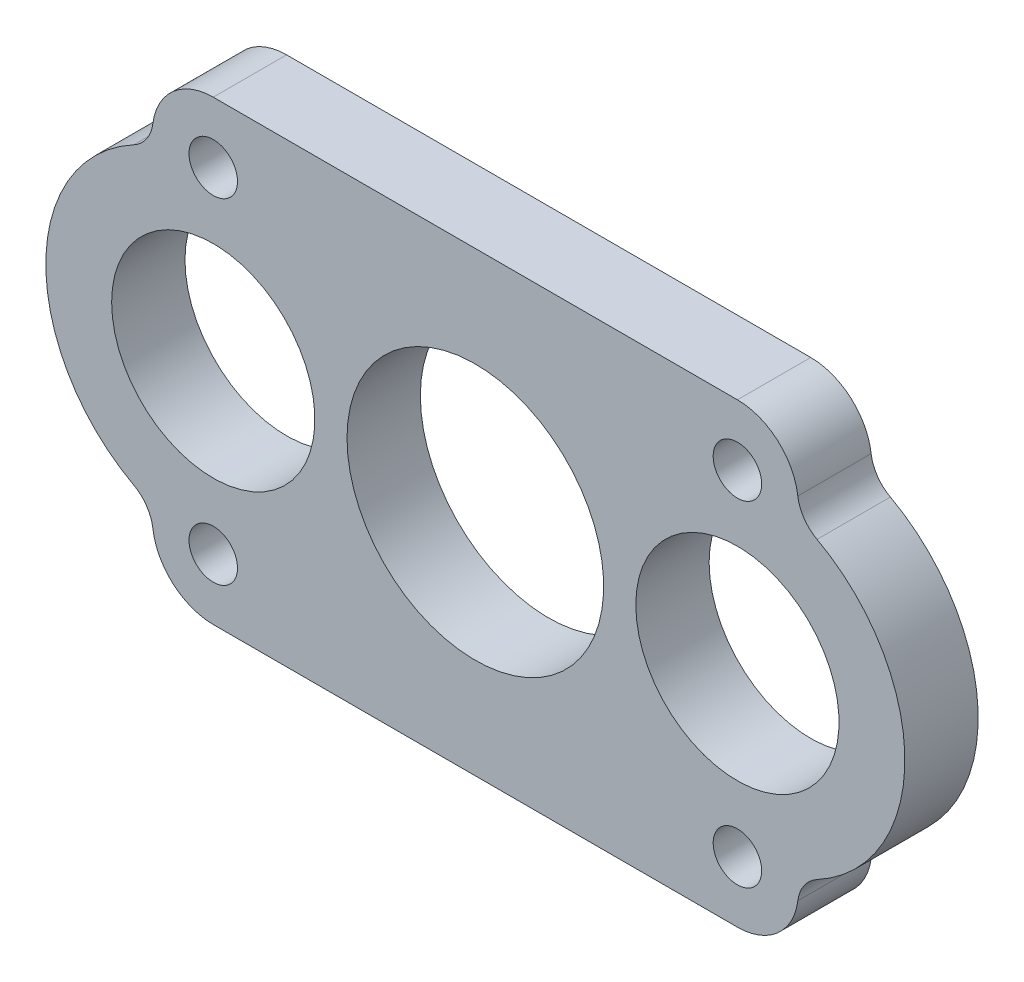
ISO-10303-21;
HEADER;
FILE_DESCRIPTION(('STEP AP214'),'2;1');
FILE_NAME('part.step','',(''),(''),'','','');
FILE_SCHEMA(('AUTOMOTIVE_DESIGN { 1 0 10303 214 1 1 1 1 }'));
ENDSEC;
DATA;
#1=APPLICATION_CONTEXT('core data for automotive mechanical design processes');
#2=APPLICATION_PROTOCOL_DEFINITION('international standard','automotive_design',2000,#1);
#3=PRODUCT_CONTEXT('',#1,'mechanical');
#4=PRODUCT('Part','Part','',(#3));
#5=PRODUCT_RELATED_PRODUCT_CATEGORY('part','',(#4));
#6=PRODUCT_DEFINITION_FORMATION('','',#4);
#7=PRODUCT_DEFINITION_CONTEXT('part definition',#1,'design');
#8=PRODUCT_DEFINITION('design','',#6,#7);
#9=PRODUCT_DEFINITION_SHAPE('','',#8);
#10=(LENGTH_UNIT() NAMED_UNIT(*) SI_UNIT(.MILLI.,.METRE.));
#11=(NAMED_UNIT(*) PLANE_ANGLE_UNIT() SI_UNIT($,.RADIAN.));
#12=(NAMED_UNIT(*) SI_UNIT($,.STERADIAN.) SOLID_ANGLE_UNIT());
#13=UNCERTAINTY_MEASURE_WITH_UNIT(LENGTH_MEASURE(1.E-05),#10,'distance_accuracy_value','');
#14=(GEOMETRIC_REPRESENTATION_CONTEXT(3) GLOBAL_UNCERTAINTY_ASSIGNED_CONTEXT((#13)) GLOBAL_UNIT_ASSIGNED_CONTEXT((#10,
#11,#12)) REPRESENTATION_CONTEXT('',''));
#15=CARTESIAN_POINT('',(0.,0.,0.));
#16=DIRECTION('',(0.,0.,1.));
#17=DIRECTION('',(1.,0.,0.));
#18=AXIS2_PLACEMENT_3D('',#15,#16,#17);
#19=CARTESIAN_POINT('',(-22.6949,0.,0.));
#20=DIRECTION('',(0.,0.,1.));
#21=DIRECTION('',(1.,0.,0.));
#22=AXIS2_PLACEMENT_3D('',#19,#20,#21);
#23=PLANE('',#22);
#24=CARTESIAN_POINT('',(22.6949,14.5,0.));
#25=DIRECTION('',(0.,0.,-1.));
#26=DIRECTION('',(-1.,0.,0.));
#27=AXIS2_PLACEMENT_3D('',#24,#25,#26);
#28=CIRCLE('',#27,2.1);
#29=CARTESIAN_POINT('',(20.5949,14.5,0.));
#30=VERTEX_POINT('',#29);
#31=EDGE_CURVE('E176',#30,#30,#28,.F.);
#32=ORIENTED_EDGE('',*,*,#31,.T.);
#33=EDGE_LOOP('',(#32));
#34=FACE_BOUND('',#33,.T.);
#35=CARTESIAN_POINT('',(22.6949,0.,0.));
#36=DIRECTION('',(0.,0.,-1.));
#37=DIRECTION('',(-1.,0.,0.));
#38=AXIS2_PLACEMENT_3D('',#35,#36,#37);
#39=CIRCLE('',#38,8.8);
#40=CARTESIAN_POINT('',(13.8949,0.,0.));
#41=VERTEX_POINT('',#40);
#42=EDGE_CURVE('E20',#41,#41,#39,.F.);
#43=ORIENTED_EDGE('',*,*,#42,.T.);
#44=EDGE_LOOP('',(#43));
#45=FACE_BOUND('',#44,.T.);
#46=CARTESIAN_POINT('',(22.6949,-14.5,0.));
#47=DIRECTION('',(0.,0.,-1.));
#48=DIRECTION('',(-1.,0.,0.));
#49=AXIS2_PLACEMENT_3D('',#46,#47,#48);
#50=CIRCLE('',#49,2.1);
#51=CARTESIAN_POINT('',(20.5949,-14.5,0.));
#52=VERTEX_POINT('',#51);
#53=EDGE_CURVE('E182',#52,#52,#50,.F.);
#54=ORIENTED_EDGE('',*,*,#53,.T.);
#55=EDGE_LOOP('',(#54));
#56=FACE_BOUND('',#55,.T.);
#57=CARTESIAN_POINT('',(-22.6949,14.5,0.));
#58=DIRECTION('',(0.,0.,-1.));
#59=DIRECTION('',(-1.,0.,0.));
#60=AXIS2_PLACEMENT_3D('',#57,#58,#59);
#61=CIRCLE('',#60,2.1);
#62=CARTESIAN_POINT('',(-24.7949,14.5,0.));
#63=VERTEX_POINT('',#62);
#64=EDGE_CURVE('E158',#63,#63,#61,.F.);
#65=ORIENTED_EDGE('',*,*,#64,.T.);
#66=EDGE_LOOP('',(#65));
#67=FACE_BOUND('',#66,.T.);
#68=CARTESIAN_POINT('',(-22.6949,-14.5,0.));
#69=DIRECTION('',(0.,0.,-1.));
#70=DIRECTION('',(-1.,0.,0.));
#71=AXIS2_PLACEMENT_3D('',#68,#69,#70);
#72=CIRCLE('',#71,2.1);
#73=CARTESIAN_POINT('',(-24.7949,-14.5,0.));
#74=VERTEX_POINT('',#73);
#75=EDGE_CURVE('E127',#74,#74,#72,.F.);
#76=ORIENTED_EDGE('',*,*,#75,.T.);
#77=EDGE_LOOP('',(#76));
#78=FACE_BOUND('',#77,.T.);
#79=CARTESIAN_POINT('',(-22.6949,0.,0.));
#80=DIRECTION('',(0.,0.,-1.));
#81=DIRECTION('',(-1.,0.,0.));
#82=AXIS2_PLACEMENT_3D('',#79,#80,#81);
#83=CIRCLE('',#82,8.8);
#84=CARTESIAN_POINT('',(-31.4949,0.,0.));
#85=VERTEX_POINT('',#84);
#86=EDGE_CURVE('E113',#85,#85,#83,.F.);
#87=ORIENTED_EDGE('',*,*,#86,.T.);
#88=EDGE_LOOP('',(#87));
#89=FACE_BOUND('',#88,.T.);
#90=CARTESIAN_POINT('',(0.,0.,0.));
#91=DIRECTION('',(0.,0.,-1.));
#92=DIRECTION('',(-1.,0.,0.));
#93=AXIS2_PLACEMENT_3D('',#90,#91,#92);
#94=CIRCLE('',#93,11.1125);
#95=CARTESIAN_POINT('',(-11.1125,0.,0.));
#96=VERTEX_POINT('',#95);
#97=EDGE_CURVE('E124',#96,#96,#94,.F.);
#98=ORIENTED_EDGE('',*,*,#97,.T.);
#99=EDGE_LOOP('',(#98));
#100=FACE_BOUND('',#99,.T.);
#101=CARTESIAN_POINT('',(-31.1251698783673,15.5927718965517,0.));
#102=DIRECTION('',(0.,0.,-1.));
#103=DIRECTION('',(-1.,0.,0.));
#104=AXIS2_PLACEMENT_3D('',#101,#102,#103);
#105=CIRCLE('',#104,3.2258);
#106=CARTESIAN_POINT('',(-29.5910013458533,12.755147440454,0.));
#107=VERTEX_POINT('',#106);
#108=CARTESIAN_POINT('',(-27.926133955438,15.178097561913,0.));
#109=VERTEX_POINT('',#108);
#110=EDGE_CURVE('E107',#107,#109,#105,.F.);
#111=ORIENTED_EDGE('',*,*,#110,.T.);
#112=CARTESIAN_POINT('',(-22.6949,14.5,0.));
#113=DIRECTION('',(0.,0.,-1.));
#114=DIRECTION('',(-1.,0.,0.));
#115=AXIS2_PLACEMENT_3D('',#112,#113,#114);
#116=CIRCLE('',#115,5.275);
#117=CARTESIAN_POINT('',(-22.6949,19.775,0.));
#118=VERTEX_POINT('',#117);
#119=EDGE_CURVE('E131',#118,#109,#116,.F.);
#120=ORIENTED_EDGE('',*,*,#119,.F.);
#121=DIRECTION('',(1.,0.,0.));
#122=VECTOR('',#121,1.);
#123=CARTESIAN_POINT('',(-22.6949,19.775,0.));
#124=LINE('',#123,#122);
#125=CARTESIAN_POINT('',(22.6949,19.775,0.));
#126=VERTEX_POINT('',#125);
#127=EDGE_CURVE('E134',#118,#126,#124,.T.);
#128=ORIENTED_EDGE('',*,*,#127,.T.);
#129=CARTESIAN_POINT('',(22.6949,14.5,0.));
#130=DIRECTION('',(0.,0.,-1.));
#131=DIRECTION('',(-1.,0.,0.));
#132=AXIS2_PLACEMENT_3D('',#129,#130,#131);
#133=CIRCLE('',#132,5.275);
#134=CARTESIAN_POINT('',(27.926133955438,15.1780975619131,0.));
#135=VERTEX_POINT('',#134);
#136=EDGE_CURVE('E135',#135,#126,#133,.F.);
#137=ORIENTED_EDGE('',*,*,#136,.F.);
#138=CARTESIAN_POINT('',(31.1251698783673,15.5927718965517,0.));
#139=DIRECTION('',(0.,0.,-1.));
#140=DIRECTION('',(-1.,0.,0.));
#141=AXIS2_PLACEMENT_3D('',#138,#139,#140);
#142=CIRCLE('',#141,3.2258);
#143=CARTESIAN_POINT('',(29.5910013458533,12.755147440454,0.));
#144=VERTEX_POINT('',#143);
#145=EDGE_CURVE('E138',#135,#144,#142,.F.);
#146=ORIENTED_EDGE('',*,*,#145,.T.);
#147=CARTESIAN_POINT('',(22.6949,0.,0.));
#148=DIRECTION('',(0.,0.,-1.));
#149=DIRECTION('',(-1.,0.,0.));
#150=AXIS2_PLACEMENT_3D('',#147,#148,#149);
#151=CIRCLE('',#150,14.5);
#152=CARTESIAN_POINT('',(29.5910013458533,-12.755147440454,0.));
#153=VERTEX_POINT('',#152);
#154=EDGE_CURVE('E142',#153,#144,#151,.F.);
#155=ORIENTED_EDGE('',*,*,#154,.F.);
#156=CARTESIAN_POINT('',(31.1251698783673,-15.5927718965517,0.));
#157=DIRECTION('',(0.,0.,-1.));
#158=DIRECTION('',(-1.,0.,0.));
#159=AXIS2_PLACEMENT_3D('',#156,#157,#158);
#160=CIRCLE('',#159,3.2258);
#161=CARTESIAN_POINT('',(27.926133955438,-15.1780975619131,0.));
#162=VERTEX_POINT('',#161);
#163=EDGE_CURVE('E145',#153,#162,#160,.F.);
#164=ORIENTED_EDGE('',*,*,#163,.T.);
#165=CARTESIAN_POINT('',(22.6949,-14.5,0.));
#166=DIRECTION('',(0.,0.,-1.));
#167=DIRECTION('',(-1.,0.,0.));
#168=AXIS2_PLACEMENT_3D('',#165,#166,#167);
#169=CIRCLE('',#168,5.275);
#170=CARTESIAN_POINT('',(22.6949,-19.775,0.));
#171=VERTEX_POINT('',#170);
#172=EDGE_CURVE('E149',#171,#162,#169,.F.);
#173=ORIENTED_EDGE('',*,*,#172,.F.);
#174=DIRECTION('',(-1.,0.,0.));
#175=VECTOR('',#174,1.);
#176=CARTESIAN_POINT('',(-22.6949,-19.775,0.));
#177=LINE('',#176,#175);
#178=CARTESIAN_POINT('',(-22.6949,-19.775,0.));
#179=VERTEX_POINT('',#178);
#180=EDGE_CURVE('E152',#171,#179,#177,.T.);
#181=ORIENTED_EDGE('',*,*,#180,.T.);
#182=CARTESIAN_POINT('',(-22.6949,-14.5,0.));
#183=DIRECTION('',(0.,0.,-1.));
#184=DIRECTION('',(-1.,0.,0.));
#185=AXIS2_PLACEMENT_3D('',#182,#183,#184);
#186=CIRCLE('',#185,5.275);
#187=CARTESIAN_POINT('',(-27.926133955438,-15.178097561913,0.));
#188=VERTEX_POINT('',#187);
#189=EDGE_CURVE('E153',#188,#179,#186,.F.);
#190=ORIENTED_EDGE('',*,*,#189,.F.);
#191=CARTESIAN_POINT('',(-31.1251698783673,-15.5927718965517,0.));
#192=DIRECTION('',(0.,0.,-1.));
#193=DIRECTION('',(-1.,0.,0.));
#194=AXIS2_PLACEMENT_3D('',#191,#192,#193);
#195=CIRCLE('',#194,3.2258);
#196=CARTESIAN_POINT('',(-29.5910013458533,-12.755147440454,0.));
#197=VERTEX_POINT('',#196);
#198=EDGE_CURVE('E109',#188,#197,#195,.F.);
#199=ORIENTED_EDGE('',*,*,#198,.T.);
#200=CARTESIAN_POINT('',(-22.6949,0.,0.));
#201=DIRECTION('',(0.,0.,-1.));
#202=DIRECTION('',(-1.,0.,0.));
#203=AXIS2_PLACEMENT_3D('',#200,#201,#202);
#204=CIRCLE('',#203,14.5);
#205=EDGE_CURVE('E104',#107,#197,#204,.F.);
#206=ORIENTED_EDGE('',*,*,#205,.F.);
#207=EDGE_LOOP('',(#111,#120,#128,#137,#146,#155,#164,#173,#181,#190,#199,#206));
#208=FACE_BOUND('',#207,.T.);
#209=ADVANCED_FACE('F17',(#34,#45,#56,#67,#78,#89,#100,#208),#23,.F.);
#210=CARTESIAN_POINT('',(22.6949,0.,6.35));
#211=DIRECTION('',(0.,0.,-1.));
#212=DIRECTION('',(-1.,0.,0.));
#213=AXIS2_PLACEMENT_3D('',#210,#211,#212);
#214=CYLINDRICAL_SURFACE('',#213,8.8);
#215=ORIENTED_EDGE('',*,*,#42,.F.);
#216=EDGE_LOOP('',(#215));
#217=FACE_BOUND('',#216,.T.);
#218=CARTESIAN_POINT('',(22.6949,0.,6.35));
#219=DIRECTION('',(0.,0.,-1.));
#220=DIRECTION('',(-1.,0.,0.));
#221=AXIS2_PLACEMENT_3D('',#218,#219,#220);
#222=CIRCLE('',#221,8.8);
#223=CARTESIAN_POINT('',(13.8949,0.,6.35));
#224=VERTEX_POINT('',#223);
#225=EDGE_CURVE('E173',#224,#224,#222,.T.);
#226=ORIENTED_EDGE('',*,*,#225,.F.);
#227=EDGE_LOOP('',(#226));
#228=FACE_BOUND('',#227,.T.);
#229=ADVANCED_FACE('F167',(#217,#228),#214,.F.);
#230=CARTESIAN_POINT('',(-22.6949,14.5,6.35));
#231=DIRECTION('',(0.,0.,-1.));
#232=DIRECTION('',(-1.,0.,0.));
#233=AXIS2_PLACEMENT_3D('',#230,#231,#232);
#234=CYLINDRICAL_SURFACE('',#233,2.1);
#235=ORIENTED_EDGE('',*,*,#64,.F.);
#236=EDGE_LOOP('',(#235));
#237=FACE_BOUND('',#236,.T.);
#238=CARTESIAN_POINT('',(-22.6949,14.5,6.35));
#239=DIRECTION('',(0.,0.,-1.));
#240=DIRECTION('',(-1.,0.,0.));
#241=AXIS2_PLACEMENT_3D('',#238,#239,#240);
#242=CIRCLE('',#241,2.1);
#243=CARTESIAN_POINT('',(-24.7949,14.5,6.35));
#244=VERTEX_POINT('',#243);
#245=EDGE_CURVE('E175',#244,#244,#242,.T.);
#246=ORIENTED_EDGE('',*,*,#245,.F.);
#247=EDGE_LOOP('',(#246));
#248=FACE_BOUND('',#247,.T.);
#249=ADVANCED_FACE('F170',(#237,#248),#234,.F.);
#250=CARTESIAN_POINT('',(-22.6949,0.,6.35));
#251=DIRECTION('',(0.,0.,-1.));
#252=DIRECTION('',(-1.,0.,0.));
#253=AXIS2_PLACEMENT_3D('',#250,#251,#252);
#254=CYLINDRICAL_SURFACE('',#253,8.8);
#255=ORIENTED_EDGE('',*,*,#86,.F.);
#256=EDGE_LOOP('',(#255));
#257=FACE_BOUND('',#256,.T.);
#258=CARTESIAN_POINT('',(-22.6949,0.,6.35));
#259=DIRECTION('',(0.,0.,-1.));
#260=DIRECTION('',(-1.,0.,0.));
#261=AXIS2_PLACEMENT_3D('',#258,#259,#260);
#262=CIRCLE('',#261,8.8);
#263=CARTESIAN_POINT('',(-31.4949,0.,6.35));
#264=VERTEX_POINT('',#263);
#265=EDGE_CURVE('E179',#264,#264,#262,.T.);
#266=ORIENTED_EDGE('',*,*,#265,.F.);
#267=EDGE_LOOP('',(#266));
#268=FACE_BOUND('',#267,.T.);
#269=ADVANCED_FACE('F243',(#257,#268),#254,.F.);
#270=CARTESIAN_POINT('',(-22.6949,0.,6.35));
#271=DIRECTION('',(0.,0.,-1.));
#272=DIRECTION('',(-1.,0.,0.));
#273=AXIS2_PLACEMENT_3D('',#270,#271,#272);
#274=CYLINDRICAL_SURFACE('',#273,14.5);
#275=CARTESIAN_POINT('',(-22.6949,0.,6.35));
#276=DIRECTION('',(0.,0.,-1.));
#277=DIRECTION('',(-1.,0.,0.));
#278=AXIS2_PLACEMENT_3D('',#275,#276,#277);
#279=CIRCLE('',#278,14.5);
#280=CARTESIAN_POINT('',(-29.5910013458533,12.755147440454,6.35));
#281=VERTEX_POINT('',#280);
#282=CARTESIAN_POINT('',(-29.5910013458533,-12.755147440454,6.35));
#283=VERTEX_POINT('',#282);
#284=EDGE_CURVE('E119',#281,#283,#279,.F.);
#285=ORIENTED_EDGE('',*,*,#284,.F.);
#286=DIRECTION('',(0.,0.,-1.));
#287=VECTOR('',#286,1.);
#288=CARTESIAN_POINT('',(-29.5910013458533,12.755147440454,6.35));
#289=LINE('',#288,#287);
#290=EDGE_CURVE('E116',#281,#107,#289,.T.);
#291=ORIENTED_EDGE('',*,*,#290,.T.);
#292=ORIENTED_EDGE('',*,*,#205,.T.);
#293=DIRECTION('',(0.,0.,-1.));
#294=VECTOR('',#293,1.);
#295=CARTESIAN_POINT('',(-29.5910013458533,-12.755147440454,6.35));
#296=LINE('',#295,#294);
#297=EDGE_CURVE('E112',#197,#283,#296,.F.);
#298=ORIENTED_EDGE('',*,*,#297,.T.);
#299=EDGE_LOOP('',(#285,#291,#292,#298));
#300=FACE_BOUND('',#299,.T.);
#301=ADVANCED_FACE('F117',(#300),#274,.T.);
#302=CARTESIAN_POINT('',(-31.1251698783673,-15.5927718965517,6.35));
#303=DIRECTION('',(0.,0.,-1.));
#304=DIRECTION('',(-1.,0.,0.));
#305=AXIS2_PLACEMENT_3D('',#302,#303,#304);
#306=CYLINDRICAL_SURFACE('',#305,3.2258);
#307=DIRECTION('',(0.,0.,-1.));
#308=VECTOR('',#307,1.);
#309=CARTESIAN_POINT('',(-27.926133955438,-15.178097561913,6.35));
#310=LINE('',#309,#308);
#311=CARTESIAN_POINT('',(-27.926133955438,-15.178097561913,6.35));
#312=VERTEX_POINT('',#311);
#313=EDGE_CURVE('E155',#312,#188,#310,.T.);
#314=ORIENTED_EDGE('',*,*,#313,.F.);
#315=CARTESIAN_POINT('',(-31.1251698783673,-15.5927718965517,6.35));
#316=DIRECTION('',(0.,0.,-1.));
#317=DIRECTION('',(-1.,0.,0.));
#318=AXIS2_PLACEMENT_3D('',#315,#316,#317);
#319=CIRCLE('',#318,3.2258);
#320=EDGE_CURVE('E234',#283,#312,#319,.T.);
#321=ORIENTED_EDGE('',*,*,#320,.F.);
#322=ORIENTED_EDGE('',*,*,#297,.F.);
#323=ORIENTED_EDGE('',*,*,#198,.F.);
#324=EDGE_LOOP('',(#314,#321,#322,#323));
#325=FACE_BOUND('',#324,.T.);
#326=ADVANCED_FACE('F252',(#325),#306,.F.);
#327=CARTESIAN_POINT('',(-22.6949,-14.5,6.35));
#328=DIRECTION('',(0.,0.,-1.));
#329=DIRECTION('',(-1.,0.,0.));
#330=AXIS2_PLACEMENT_3D('',#327,#328,#329);
#331=CYLINDRICAL_SURFACE('',#330,5.275);
#332=CARTESIAN_POINT('',(-22.6949,-14.5,6.35));
#333=DIRECTION('',(0.,0.,-1.));
#334=DIRECTION('',(-1.,0.,0.));
#335=AXIS2_PLACEMENT_3D('',#332,#333,#334);
#336=CIRCLE('',#335,5.275);
#337=CARTESIAN_POINT('',(-22.6949,-19.775,6.35));
#338=VERTEX_POINT('',#337);
#339=EDGE_CURVE('E231',#312,#338,#336,.F.);
#340=ORIENTED_EDGE('',*,*,#339,.F.);
#341=ORIENTED_EDGE('',*,*,#313,.T.);
#342=ORIENTED_EDGE('',*,*,#189,.T.);
#343=DIRECTION('',(0.,0.,1.));
#344=VECTOR('',#343,1.);
#345=CARTESIAN_POINT('',(-22.6949,-19.775,6.35));
#346=LINE('',#345,#344);
#347=EDGE_CURVE('E318',#179,#338,#346,.T.);
#348=ORIENTED_EDGE('',*,*,#347,.T.);
#349=EDGE_LOOP('',(#340,#341,#342,#348));
#350=FACE_BOUND('',#349,.T.);
#351=ADVANCED_FACE('F306',(#350),#331,.T.);
#352=CARTESIAN_POINT('',(-22.6949,-19.775,6.35));
#353=DIRECTION('',(0.,1.,0.));
#354=DIRECTION('',(-1.,0.,0.));
#355=AXIS2_PLACEMENT_3D('',#352,#353,#354);
#356=PLANE('',#355);
#357=DIRECTION('',(0.,0.,-1.));
#358=VECTOR('',#357,1.);
#359=CARTESIAN_POINT('',(22.6949,-19.775,6.35));
#360=LINE('',#359,#358);
#361=CARTESIAN_POINT('',(22.6949,-19.775,6.35));
#362=VERTEX_POINT('',#361);
#363=EDGE_CURVE('E151',#362,#171,#360,.T.);
#364=ORIENTED_EDGE('',*,*,#363,.F.);
#365=DIRECTION('',(1.,0.,0.));
#366=VECTOR('',#365,1.);
#367=CARTESIAN_POINT('',(-22.6949,-19.775,6.35));
#368=LINE('',#367,#366);
#369=EDGE_CURVE('E230',#338,#362,#368,.T.);
#370=ORIENTED_EDGE('',*,*,#369,.F.);
#371=ORIENTED_EDGE('',*,*,#347,.F.);
#372=ORIENTED_EDGE('',*,*,#180,.F.);
#373=EDGE_LOOP('',(#364,#370,#371,#372));
#374=FACE_BOUND('',#373,.T.);
#375=ADVANCED_FACE('F302',(#374),#356,.F.);
#376=CARTESIAN_POINT('',(22.6949,-14.5,6.35));
#377=DIRECTION('',(0.,0.,-1.));
#378=DIRECTION('',(-1.,0.,0.));
#379=AXIS2_PLACEMENT_3D('',#376,#377,#378);
#380=CYLINDRICAL_SURFACE('',#379,5.275);
#381=CARTESIAN_POINT('',(22.6949,-14.5,6.35));
#382=DIRECTION('',(0.,0.,-1.));
#383=DIRECTION('',(-1.,0.,0.));
#384=AXIS2_PLACEMENT_3D('',#381,#382,#383);
#385=CIRCLE('',#384,5.275);
#386=CARTESIAN_POINT('',(27.926133955438,-15.1780975619131,6.35));
#387=VERTEX_POINT('',#386);
#388=EDGE_CURVE('E227',#362,#387,#385,.F.);
#389=ORIENTED_EDGE('',*,*,#388,.F.);
#390=ORIENTED_EDGE('',*,*,#363,.T.);
#391=ORIENTED_EDGE('',*,*,#172,.T.);
#392=DIRECTION('',(0.,0.,-1.));
#393=VECTOR('',#392,1.);
#394=CARTESIAN_POINT('',(27.926133955438,-15.1780975619131,6.35));
#395=LINE('',#394,#393);
#396=EDGE_CURVE('E148',#162,#387,#395,.F.);
#397=ORIENTED_EDGE('',*,*,#396,.T.);
#398=EDGE_LOOP('',(#389,#390,#391,#397));
#399=FACE_BOUND('',#398,.T.);
#400=ADVANCED_FACE('F298',(#399),#380,.T.);
#401=CARTESIAN_POINT('',(31.1251698783673,-15.5927718965517,6.35));
#402=DIRECTION('',(0.,0.,-1.));
#403=DIRECTION('',(-1.,0.,0.));
#404=AXIS2_PLACEMENT_3D('',#401,#402,#403);
#405=CYLINDRICAL_SURFACE('',#404,3.2258);
#406=DIRECTION('',(0.,0.,-1.));
#407=VECTOR('',#406,1.);
#408=CARTESIAN_POINT('',(29.5910013458533,-12.755147440454,6.35));
#409=LINE('',#408,#407);
#410=CARTESIAN_POINT('',(29.5910013458533,-12.755147440454,6.35));
#411=VERTEX_POINT('',#410);
#412=EDGE_CURVE('E144',#411,#153,#409,.T.);
#413=ORIENTED_EDGE('',*,*,#412,.F.);
#414=CARTESIAN_POINT('',(31.1251698783673,-15.5927718965517,6.35));
#415=DIRECTION('',(0.,0.,-1.));
#416=DIRECTION('',(-1.,0.,0.));
#417=AXIS2_PLACEMENT_3D('',#414,#415,#416);
#418=CIRCLE('',#417,3.2258);
#419=EDGE_CURVE('E224',#387,#411,#418,.T.);
#420=ORIENTED_EDGE('',*,*,#419,.F.);
#421=ORIENTED_EDGE('',*,*,#396,.F.);
#422=ORIENTED_EDGE('',*,*,#163,.F.);
#423=EDGE_LOOP('',(#413,#420,#421,#422));
#424=FACE_BOUND('',#423,.T.);
#425=ADVANCED_FACE('F294',(#424),#405,.F.);
#426=CARTESIAN_POINT('',(22.6949,0.,6.35));
#427=DIRECTION('',(0.,0.,-1.));
#428=DIRECTION('',(-1.,0.,0.));
#429=AXIS2_PLACEMENT_3D('',#426,#427,#428);
#430=CYLINDRICAL_SURFACE('',#429,14.5);
#431=CARTESIAN_POINT('',(22.6949,0.,6.35));
#432=DIRECTION('',(0.,0.,-1.));
#433=DIRECTION('',(-1.,0.,0.));
#434=AXIS2_PLACEMENT_3D('',#431,#432,#433);
#435=CIRCLE('',#434,14.5);
#436=CARTESIAN_POINT('',(29.5910013458533,12.755147440454,6.35));
#437=VERTEX_POINT('',#436);
#438=EDGE_CURVE('E221',#411,#437,#435,.F.);
#439=ORIENTED_EDGE('',*,*,#438,.F.);
#440=ORIENTED_EDGE('',*,*,#412,.T.);
#441=ORIENTED_EDGE('',*,*,#154,.T.);
#442=DIRECTION('',(0.,0.,-1.));
#443=VECTOR('',#442,1.);
#444=CARTESIAN_POINT('',(29.5910013458533,12.755147440454,6.35));
#445=LINE('',#444,#443);
#446=EDGE_CURVE('E141',#144,#437,#445,.F.);
#447=ORIENTED_EDGE('',*,*,#446,.T.);
#448=EDGE_LOOP('',(#439,#440,#441,#447));
#449=FACE_BOUND('',#448,.T.);
#450=ADVANCED_FACE('F290',(#449),#430,.T.);
#451=CARTESIAN_POINT('',(31.1251698783673,15.5927718965517,6.35));
#452=DIRECTION('',(0.,0.,-1.));
#453=DIRECTION('',(-1.,0.,0.));
#454=AXIS2_PLACEMENT_3D('',#451,#452,#453);
#455=CYLINDRICAL_SURFACE('',#454,3.2258);
#456=DIRECTION('',(0.,0.,-1.));
#457=VECTOR('',#456,1.);
#458=CARTESIAN_POINT('',(27.926133955438,15.1780975619131,6.35));
#459=LINE('',#458,#457);
#460=CARTESIAN_POINT('',(27.926133955438,15.1780975619131,6.35));
#461=VERTEX_POINT('',#460);
#462=EDGE_CURVE('E137',#461,#135,#459,.T.);
#463=ORIENTED_EDGE('',*,*,#462,.F.);
#464=CARTESIAN_POINT('',(31.1251698783673,15.5927718965517,6.35));
#465=DIRECTION('',(0.,0.,-1.));
#466=DIRECTION('',(-1.,0.,0.));
#467=AXIS2_PLACEMENT_3D('',#464,#465,#466);
#468=CIRCLE('',#467,3.2258);
#469=EDGE_CURVE('E218',#437,#461,#468,.T.);
#470=ORIENTED_EDGE('',*,*,#469,.F.);
#471=ORIENTED_EDGE('',*,*,#446,.F.);
#472=ORIENTED_EDGE('',*,*,#145,.F.);
#473=EDGE_LOOP('',(#463,#470,#471,#472));
#474=FACE_BOUND('',#473,.T.);
#475=ADVANCED_FACE('F286',(#474),#455,.F.);
#476=CARTESIAN_POINT('',(22.6949,14.5,6.35));
#477=DIRECTION('',(0.,0.,-1.));
#478=DIRECTION('',(-1.,0.,0.));
#479=AXIS2_PLACEMENT_3D('',#476,#477,#478);
#480=CYLINDRICAL_SURFACE('',#479,5.275);
#481=CARTESIAN_POINT('',(22.6949,14.5,6.35));
#482=DIRECTION('',(0.,0.,-1.));
#483=DIRECTION('',(-1.,0.,0.));
#484=AXIS2_PLACEMENT_3D('',#481,#482,#483);
#485=CIRCLE('',#484,5.275);
#486=CARTESIAN_POINT('',(22.6949,19.775,6.35));
#487=VERTEX_POINT('',#486);
#488=EDGE_CURVE('E215',#461,#487,#485,.F.);
#489=ORIENTED_EDGE('',*,*,#488,.F.);
#490=ORIENTED_EDGE('',*,*,#462,.T.);
#491=ORIENTED_EDGE('',*,*,#136,.T.);
#492=DIRECTION('',(0.,0.,1.));
#493=VECTOR('',#492,1.);
#494=CARTESIAN_POINT('',(22.6949,19.775,6.35));
#495=LINE('',#494,#493);
#496=EDGE_CURVE('E331',#126,#487,#495,.T.);
#497=ORIENTED_EDGE('',*,*,#496,.T.);
#498=EDGE_LOOP('',(#489,#490,#491,#497));
#499=FACE_BOUND('',#498,.T.);
#500=ADVANCED_FACE('F282',(#499),#480,.T.);
#501=CARTESIAN_POINT('',(-22.6949,19.775,6.35));
#502=DIRECTION('',(0.,-1.,0.));
#503=DIRECTION('',(1.,0.,0.));
#504=AXIS2_PLACEMENT_3D('',#501,#502,#503);
#505=PLANE('',#504);
#506=DIRECTION('',(0.,0.,-1.));
#507=VECTOR('',#506,1.);
#508=CARTESIAN_POINT('',(-22.6949,19.775,6.35));
#509=LINE('',#508,#507);
#510=CARTESIAN_POINT('',(-22.6949,19.775,6.35));
#511=VERTEX_POINT('',#510);
#512=EDGE_CURVE('E133',#511,#118,#509,.T.);
#513=ORIENTED_EDGE('',*,*,#512,.F.);
#514=DIRECTION('',(1.,0.,0.));
#515=VECTOR('',#514,1.);
#516=CARTESIAN_POINT('',(-22.6949,19.775,6.35));
#517=LINE('',#516,#515);
#518=EDGE_CURVE('E214',#487,#511,#517,.F.);
#519=ORIENTED_EDGE('',*,*,#518,.F.);
#520=ORIENTED_EDGE('',*,*,#496,.F.);
#521=ORIENTED_EDGE('',*,*,#127,.F.);
#522=EDGE_LOOP('',(#513,#519,#520,#521));
#523=FACE_BOUND('',#522,.T.);
#524=ADVANCED_FACE('F279',(#523),#505,.F.);
#525=CARTESIAN_POINT('',(-22.6949,14.5,6.35));
#526=DIRECTION('',(0.,0.,-1.));
#527=DIRECTION('',(-1.,0.,0.));
#528=AXIS2_PLACEMENT_3D('',#525,#526,#527);
#529=CYLINDRICAL_SURFACE('',#528,5.275);
#530=CARTESIAN_POINT('',(-22.6949,14.5,6.35));
#531=DIRECTION('',(0.,0.,-1.));
#532=DIRECTION('',(-1.,0.,0.));
#533=AXIS2_PLACEMENT_3D('',#530,#531,#532);
#534=CIRCLE('',#533,5.275);
#535=CARTESIAN_POINT('',(-27.926133955438,15.178097561913,6.35));
#536=VERTEX_POINT('',#535);
#537=EDGE_CURVE('E211',#511,#536,#534,.F.);
#538=ORIENTED_EDGE('',*,*,#537,.F.);
#539=ORIENTED_EDGE('',*,*,#512,.T.);
#540=ORIENTED_EDGE('',*,*,#119,.T.);
#541=DIRECTION('',(0.,0.,-1.));
#542=VECTOR('',#541,1.);
#543=CARTESIAN_POINT('',(-27.926133955438,15.178097561913,6.35));
#544=LINE('',#543,#542);
#545=EDGE_CURVE('E35',#109,#536,#544,.F.);
#546=ORIENTED_EDGE('',*,*,#545,.T.);
#547=EDGE_LOOP('',(#538,#539,#540,#546));
#548=FACE_BOUND('',#547,.T.);
#549=ADVANCED_FACE('F276',(#548),#529,.T.);
#550=CARTESIAN_POINT('',(-31.1251698783673,15.5927718965517,6.35));
#551=DIRECTION('',(0.,0.,-1.));
#552=DIRECTION('',(-1.,0.,0.));
#553=AXIS2_PLACEMENT_3D('',#550,#551,#552);
#554=CYLINDRICAL_SURFACE('',#553,3.2258);
#555=ORIENTED_EDGE('',*,*,#290,.F.);
#556=CARTESIAN_POINT('',(-31.1251698783673,15.5927718965517,6.35));
#557=DIRECTION('',(0.,0.,-1.));
#558=DIRECTION('',(-1.,0.,0.));
#559=AXIS2_PLACEMENT_3D('',#556,#557,#558);
#560=CIRCLE('',#559,3.2258);
#561=EDGE_CURVE('E207',#536,#281,#560,.T.);
#562=ORIENTED_EDGE('',*,*,#561,.F.);
#563=ORIENTED_EDGE('',*,*,#545,.F.);
#564=ORIENTED_EDGE('',*,*,#110,.F.);
#565=EDGE_LOOP('',(#555,#562,#563,#564));
#566=FACE_BOUND('',#565,.T.);
#567=ADVANCED_FACE('F123',(#566),#554,.F.);
#568=CARTESIAN_POINT('',(0.,0.,6.35));
#569=DIRECTION('',(0.,0.,-1.));
#570=DIRECTION('',(-1.,0.,0.));
#571=AXIS2_PLACEMENT_3D('',#568,#569,#570);
#572=CYLINDRICAL_SURFACE('',#571,11.1125);
#573=ORIENTED_EDGE('',*,*,#97,.F.);
#574=EDGE_LOOP('',(#573));
#575=FACE_BOUND('',#574,.T.);
#576=CARTESIAN_POINT('',(0.,0.,6.35));
#577=DIRECTION('',(0.,0.,-1.));
#578=DIRECTION('',(-1.,0.,0.));
#579=AXIS2_PLACEMENT_3D('',#576,#577,#578);
#580=CIRCLE('',#579,11.1125);
#581=CARTESIAN_POINT('',(-11.1125,0.,6.35));
#582=VERTEX_POINT('',#581);
#583=EDGE_CURVE('E202',#582,#582,#580,.T.);
#584=ORIENTED_EDGE('',*,*,#583,.F.);
#585=EDGE_LOOP('',(#584));
#586=FACE_BOUND('',#585,.T.);
#587=ADVANCED_FACE('F196',(#575,#586),#572,.F.);
#588=CARTESIAN_POINT('',(-22.6949,-14.5,6.35));
#589=DIRECTION('',(0.,0.,-1.));
#590=DIRECTION('',(-1.,0.,0.));
#591=AXIS2_PLACEMENT_3D('',#588,#589,#590);
#592=CYLINDRICAL_SURFACE('',#591,2.1);
#593=ORIENTED_EDGE('',*,*,#75,.F.);
#594=EDGE_LOOP('',(#593));
#595=FACE_BOUND('',#594,.T.);
#596=CARTESIAN_POINT('',(-22.6949,-14.5,6.35));
#597=DIRECTION('',(0.,0.,-1.));
#598=DIRECTION('',(-1.,0.,0.));
#599=AXIS2_PLACEMENT_3D('',#596,#597,#598);
#600=CIRCLE('',#599,2.1);
#601=CARTESIAN_POINT('',(-24.7949,-14.5,6.35));
#602=VERTEX_POINT('',#601);
#603=EDGE_CURVE('E200',#602,#602,#600,.T.);
#604=ORIENTED_EDGE('',*,*,#603,.F.);
#605=EDGE_LOOP('',(#604));
#606=FACE_BOUND('',#605,.T.);
#607=ADVANCED_FACE('F192',(#595,#606),#592,.F.);
#608=CARTESIAN_POINT('',(22.6949,-14.5,6.35));
#609=DIRECTION('',(0.,0.,-1.));
#610=DIRECTION('',(-1.,0.,0.));
#611=AXIS2_PLACEMENT_3D('',#608,#609,#610);
#612=CYLINDRICAL_SURFACE('',#611,2.1);
#613=ORIENTED_EDGE('',*,*,#53,.F.);
#614=EDGE_LOOP('',(#613));
#615=FACE_BOUND('',#614,.T.);
#616=CARTESIAN_POINT('',(22.6949,-14.5,6.35));
#617=DIRECTION('',(0.,0.,-1.));
#618=DIRECTION('',(-1.,0.,0.));
#619=AXIS2_PLACEMENT_3D('',#616,#617,#618);
#620=CIRCLE('',#619,2.1);
#621=CARTESIAN_POINT('',(20.5949,-14.5,6.35));
#622=VERTEX_POINT('',#621);
#623=EDGE_CURVE('E26',#622,#622,#620,.T.);
#624=ORIENTED_EDGE('',*,*,#623,.F.);
#625=EDGE_LOOP('',(#624));
#626=FACE_BOUND('',#625,.T.);
#627=ADVANCED_FACE('F195',(#615,#626),#612,.F.);
#628=CARTESIAN_POINT('',(22.6949,14.5,6.35));
#629=DIRECTION('',(0.,0.,-1.));
#630=DIRECTION('',(-1.,0.,0.));
#631=AXIS2_PLACEMENT_3D('',#628,#629,#630);
#632=CYLINDRICAL_SURFACE('',#631,2.1);
#633=ORIENTED_EDGE('',*,*,#31,.F.);
#634=EDGE_LOOP('',(#633));
#635=FACE_BOUND('',#634,.T.);
#636=CARTESIAN_POINT('',(22.6949,14.5,6.35));
#637=DIRECTION('',(0.,0.,-1.));
#638=DIRECTION('',(-1.,0.,0.));
#639=AXIS2_PLACEMENT_3D('',#636,#637,#638);
#640=CIRCLE('',#639,2.1);
#641=CARTESIAN_POINT('',(20.5949,14.5,6.35));
#642=VERTEX_POINT('',#641);
#643=EDGE_CURVE('E11',#642,#642,#640,.T.);
#644=ORIENTED_EDGE('',*,*,#643,.F.);
#645=EDGE_LOOP('',(#644));
#646=FACE_BOUND('',#645,.T.);
#647=ADVANCED_FACE('F258',(#635,#646),#632,.F.);
#648=CARTESIAN_POINT('',(-22.6949,0.,6.35));
#649=DIRECTION('',(0.,0.,1.));
#650=DIRECTION('',(1.,0.,0.));
#651=AXIS2_PLACEMENT_3D('',#648,#649,#650);
#652=PLANE('',#651);
#653=ORIENTED_EDGE('',*,*,#643,.T.);
#654=EDGE_LOOP('',(#653));
#655=FACE_BOUND('',#654,.T.);
#656=ORIENTED_EDGE('',*,*,#623,.T.);
#657=EDGE_LOOP('',(#656));
#658=FACE_BOUND('',#657,.T.);
#659=ORIENTED_EDGE('',*,*,#603,.T.);
#660=EDGE_LOOP('',(#659));
#661=FACE_BOUND('',#660,.T.);
#662=ORIENTED_EDGE('',*,*,#583,.T.);
#663=EDGE_LOOP('',(#662));
#664=FACE_BOUND('',#663,.T.);
#665=ORIENTED_EDGE('',*,*,#537,.T.);
#666=ORIENTED_EDGE('',*,*,#561,.T.);
#667=ORIENTED_EDGE('',*,*,#284,.T.);
#668=ORIENTED_EDGE('',*,*,#320,.T.);
#669=ORIENTED_EDGE('',*,*,#339,.T.);
#670=ORIENTED_EDGE('',*,*,#369,.T.);
#671=ORIENTED_EDGE('',*,*,#388,.T.);
#672=ORIENTED_EDGE('',*,*,#419,.T.);
#673=ORIENTED_EDGE('',*,*,#438,.T.);
#674=ORIENTED_EDGE('',*,*,#469,.T.);
#675=ORIENTED_EDGE('',*,*,#488,.T.);
#676=ORIENTED_EDGE('',*,*,#518,.T.);
#677=EDGE_LOOP('',(#665,#666,#667,#668,#669,#670,#671,#672,#673,#674,#675,#676));
#678=FACE_BOUND('',#677,.T.);
#679=ORIENTED_EDGE('',*,*,#265,.T.);
#680=EDGE_LOOP('',(#679));
#681=FACE_BOUND('',#680,.T.);
#682=ORIENTED_EDGE('',*,*,#245,.T.);
#683=EDGE_LOOP('',(#682));
#684=FACE_BOUND('',#683,.T.);
#685=ORIENTED_EDGE('',*,*,#225,.T.);
#686=EDGE_LOOP('',(#685));
#687=FACE_BOUND('',#686,.T.);
#688=ADVANCED_FACE('F240',(#655,#658,#661,#664,#678,#681,#684,#687),#652,.T.);
#689=CLOSED_SHELL('',(#209,#229,#249,#269,#301,#326,#351,#375,#400,#425,#450,#475,#500,#524,
#549,#567,#587,#607,#627,#647,#688));
#690=MANIFOLD_SOLID_BREP('B1',#689);
#691=ADVANCED_BREP_SHAPE_REPRESENTATION('',(#18,#690),#14);
#692=SHAPE_DEFINITION_REPRESENTATION(#9,#691);
ENDSEC;
END-ISO-10303-21;
